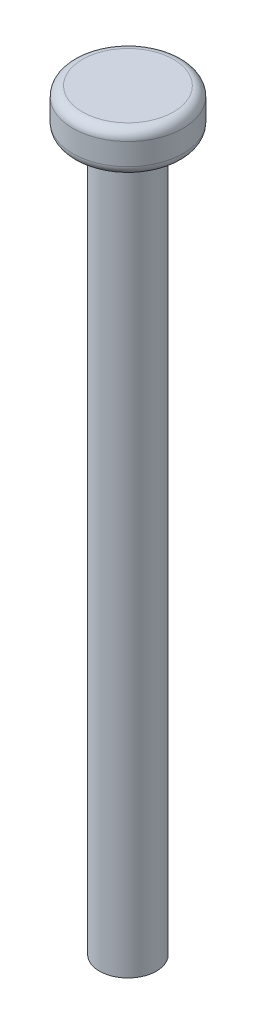
ISO-10303-21;
HEADER;
FILE_DESCRIPTION(('STEP AP214'),'2;1');
FILE_NAME('part.step','',(''),(''),'','','');
FILE_SCHEMA(('AUTOMOTIVE_DESIGN { 1 0 10303 214 1 1 1 1 }'));
ENDSEC;
DATA;
#1=APPLICATION_CONTEXT('core data for automotive mechanical design processes');
#2=APPLICATION_PROTOCOL_DEFINITION('international standard','automotive_design',2000,#1);
#3=PRODUCT_CONTEXT('',#1,'mechanical');
#4=PRODUCT('Part','Part','',(#3));
#5=PRODUCT_RELATED_PRODUCT_CATEGORY('part','',(#4));
#6=PRODUCT_DEFINITION_FORMATION('','',#4);
#7=PRODUCT_DEFINITION_CONTEXT('part definition',#1,'design');
#8=PRODUCT_DEFINITION('design','',#6,#7);
#9=PRODUCT_DEFINITION_SHAPE('','',#8);
#10=(LENGTH_UNIT() NAMED_UNIT(*) SI_UNIT(.MILLI.,.METRE.));
#11=(NAMED_UNIT(*) PLANE_ANGLE_UNIT() SI_UNIT($,.RADIAN.));
#12=(NAMED_UNIT(*) SI_UNIT($,.STERADIAN.) SOLID_ANGLE_UNIT());
#13=UNCERTAINTY_MEASURE_WITH_UNIT(LENGTH_MEASURE(1.E-05),#10,'distance_accuracy_value','');
#14=(GEOMETRIC_REPRESENTATION_CONTEXT(3) GLOBAL_UNCERTAINTY_ASSIGNED_CONTEXT((#13)) GLOBAL_UNIT_ASSIGNED_CONTEXT((#10,
#11,#12)) REPRESENTATION_CONTEXT('',''));
#15=CARTESIAN_POINT('',(0.,0.,0.));
#16=DIRECTION('',(0.,0.,1.));
#17=DIRECTION('',(1.,0.,0.));
#18=AXIS2_PLACEMENT_3D('',#15,#16,#17);
#19=CARTESIAN_POINT('',(0.,75.,0.));
#20=DIRECTION('',(0.,-1.,0.));
#21=DIRECTION('',(0.,0.,-1.));
#22=AXIS2_PLACEMENT_3D('',#19,#20,#21);
#23=CYLINDRICAL_SURFACE('',#22,3.);
#24=CARTESIAN_POINT('',(0.,75.,0.));
#25=DIRECTION('',(0.,1.,0.));
#26=DIRECTION('',(0.,0.,1.));
#27=AXIS2_PLACEMENT_3D('',#24,#25,#26);
#28=CIRCLE('',#27,3.);
#29=CARTESIAN_POINT('',(0.,75.,3.));
#30=VERTEX_POINT('',#29);
#31=EDGE_CURVE('E53',#30,#30,#28,.T.);
#32=ORIENTED_EDGE('',*,*,#31,.F.);
#33=EDGE_LOOP('',(#32));
#34=FACE_BOUND('',#33,.T.);
#35=CARTESIAN_POINT('',(0.,0.,0.));
#36=DIRECTION('',(0.,1.,0.));
#37=DIRECTION('',(0.,0.,1.));
#38=AXIS2_PLACEMENT_3D('',#35,#36,#37);
#39=CIRCLE('',#38,3.);
#40=CARTESIAN_POINT('',(0.,0.,3.));
#41=VERTEX_POINT('',#40);
#42=EDGE_CURVE('E54',#41,#41,#39,.T.);
#43=ORIENTED_EDGE('',*,*,#42,.T.);
#44=EDGE_LOOP('',(#43));
#45=FACE_BOUND('',#44,.T.);
#46=ADVANCED_FACE('F33',(#34,#45),#23,.T.);
#47=CARTESIAN_POINT('',(0.,0.,0.));
#48=DIRECTION('',(0.,1.,0.));
#49=DIRECTION('',(0.,0.,1.));
#50=AXIS2_PLACEMENT_3D('',#47,#48,#49);
#51=PLANE('',#50);
#52=ORIENTED_EDGE('',*,*,#42,.F.);
#53=EDGE_LOOP('',(#52));
#54=FACE_BOUND('',#53,.T.);
#55=ADVANCED_FACE('F64',(#54),#51,.F.);
#56=CARTESIAN_POINT('',(0.,79.3,0.));
#57=DIRECTION('',(0.,-1.,0.));
#58=DIRECTION('',(0.,0.,-1.));
#59=AXIS2_PLACEMENT_3D('',#56,#57,#58);
#60=CYLINDRICAL_SURFACE('',#59,5.8);
#61=CARTESIAN_POINT('',(0.,76.,0.));
#62=DIRECTION('',(0.,1.,0.));
#63=DIRECTION('',(0.,0.,1.));
#64=AXIS2_PLACEMENT_3D('',#61,#62,#63);
#65=CIRCLE('',#64,5.8);
#66=CARTESIAN_POINT('',(0.,76.,5.8));
#67=VERTEX_POINT('',#66);
#68=EDGE_CURVE('E44',#67,#67,#65,.T.);
#69=ORIENTED_EDGE('',*,*,#68,.T.);
#70=EDGE_LOOP('',(#69));
#71=FACE_BOUND('',#70,.T.);
#72=CARTESIAN_POINT('',(0.,78.3,0.));
#73=DIRECTION('',(0.,1.,0.));
#74=DIRECTION('',(0.,0.,1.));
#75=AXIS2_PLACEMENT_3D('',#72,#73,#74);
#76=CIRCLE('',#75,5.8);
#77=CARTESIAN_POINT('',(0.,78.3,5.8));
#78=VERTEX_POINT('',#77);
#79=EDGE_CURVE('E48',#78,#78,#76,.F.);
#80=ORIENTED_EDGE('',*,*,#79,.T.);
#81=EDGE_LOOP('',(#80));
#82=FACE_BOUND('',#81,.T.);
#83=ADVANCED_FACE('F69',(#71,#82),#60,.T.);
#84=CARTESIAN_POINT('',(0.,79.3,0.));
#85=DIRECTION('',(0.,1.,0.));
#86=DIRECTION('',(0.,0.,1.));
#87=AXIS2_PLACEMENT_3D('',#84,#85,#86);
#88=PLANE('',#87);
#89=CARTESIAN_POINT('',(0.,79.3,0.));
#90=DIRECTION('',(0.,1.,0.));
#91=DIRECTION('',(0.,0.,1.));
#92=AXIS2_PLACEMENT_3D('',#89,#90,#91);
#93=CIRCLE('',#92,4.8);
#94=CARTESIAN_POINT('',(0.,79.3,4.8));
#95=VERTEX_POINT('',#94);
#96=EDGE_CURVE('E10',#95,#95,#93,.T.);
#97=ORIENTED_EDGE('',*,*,#96,.T.);
#98=EDGE_LOOP('',(#97));
#99=FACE_BOUND('',#98,.T.);
#100=ADVANCED_FACE('F74',(#99),#88,.T.);
#101=CARTESIAN_POINT('',(0.,75.,0.));
#102=DIRECTION('',(0.,1.,0.));
#103=DIRECTION('',(0.,0.,1.));
#104=AXIS2_PLACEMENT_3D('',#101,#102,#103);
#105=PLANE('',#104);
#106=CARTESIAN_POINT('',(0.,75.,0.));
#107=DIRECTION('',(0.,1.,0.));
#108=DIRECTION('',(0.,0.,1.));
#109=AXIS2_PLACEMENT_3D('',#106,#107,#108);
#110=CIRCLE('',#109,4.8);
#111=CARTESIAN_POINT('',(0.,75.,4.8));
#112=VERTEX_POINT('',#111);
#113=EDGE_CURVE('E40',#112,#112,#110,.F.);
#114=ORIENTED_EDGE('',*,*,#113,.T.);
#115=EDGE_LOOP('',(#114));
#116=FACE_BOUND('',#115,.T.);
#117=ORIENTED_EDGE('',*,*,#31,.T.);
#118=EDGE_LOOP('',(#117));
#119=FACE_BOUND('',#118,.T.);
#120=ADVANCED_FACE('F60',(#116,#119),#105,.F.);
#121=CARTESIAN_POINT('',(0.,76.,0.));
#122=DIRECTION('',(0.,1.,0.));
#123=DIRECTION('',(0.,0.,1.));
#124=AXIS2_PLACEMENT_3D('',#121,#122,#123);
#125=TOROIDAL_SURFACE('',#124,4.8,1.);
#126=ORIENTED_EDGE('',*,*,#113,.F.);
#127=EDGE_LOOP('',(#126));
#128=FACE_BOUND('',#127,.T.);
#129=ORIENTED_EDGE('',*,*,#68,.F.);
#130=EDGE_LOOP('',(#129));
#131=FACE_BOUND('',#130,.T.);
#132=ADVANCED_FACE('F78',(#128,#131),#125,.T.);
#133=CARTESIAN_POINT('',(0.,78.3,0.));
#134=DIRECTION('',(0.,1.,0.));
#135=DIRECTION('',(0.,0.,1.));
#136=AXIS2_PLACEMENT_3D('',#133,#134,#135);
#137=TOROIDAL_SURFACE('',#136,4.8,1.);
#138=ORIENTED_EDGE('',*,*,#79,.F.);
#139=EDGE_LOOP('',(#138));
#140=FACE_BOUND('',#139,.T.);
#141=ORIENTED_EDGE('',*,*,#96,.F.);
#142=EDGE_LOOP('',(#141));
#143=FACE_BOUND('',#142,.T.);
#144=ADVANCED_FACE('F35',(#140,#143),#137,.T.);
#145=CLOSED_SHELL('',(#46,#55,#83,#100,#120,#132,#144));
#146=MANIFOLD_SOLID_BREP('B2',#145);
#147=ADVANCED_BREP_SHAPE_REPRESENTATION('',(#18,#146),#14);
#148=SHAPE_DEFINITION_REPRESENTATION(#9,#147);
ENDSEC;
END-ISO-10303-21;
